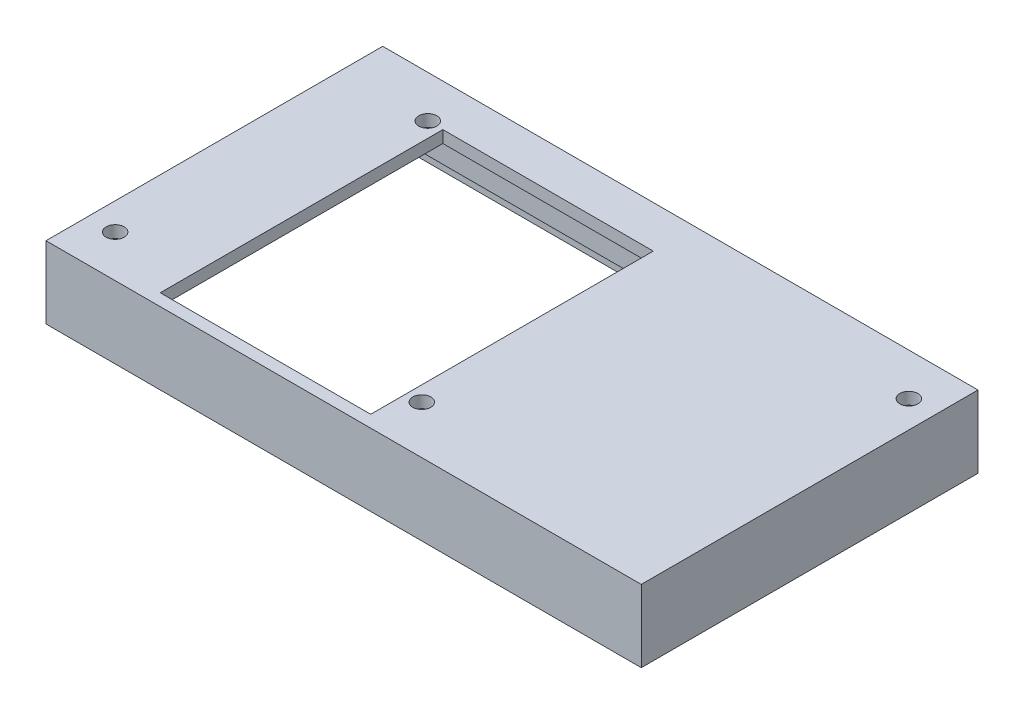
ISO-10303-21;
HEADER;
FILE_DESCRIPTION(('STEP AP214'),'2;1');
FILE_NAME('part.step','',(''),(''),'','','');
FILE_SCHEMA(('AUTOMOTIVE_DESIGN { 1 0 10303 214 1 1 1 1 }'));
ENDSEC;
DATA;
#1=APPLICATION_CONTEXT('core data for automotive mechanical design processes');
#2=APPLICATION_PROTOCOL_DEFINITION('international standard','automotive_design',2000,#1);
#3=PRODUCT_CONTEXT('',#1,'mechanical');
#4=PRODUCT('Part','Part','',(#3));
#5=PRODUCT_RELATED_PRODUCT_CATEGORY('part','',(#4));
#6=PRODUCT_DEFINITION_FORMATION('','',#4);
#7=PRODUCT_DEFINITION_CONTEXT('part definition',#1,'design');
#8=PRODUCT_DEFINITION('design','',#6,#7);
#9=PRODUCT_DEFINITION_SHAPE('','',#8);
#10=(LENGTH_UNIT() NAMED_UNIT(*) SI_UNIT(.MILLI.,.METRE.));
#11=(NAMED_UNIT(*) PLANE_ANGLE_UNIT() SI_UNIT($,.RADIAN.));
#12=(NAMED_UNIT(*) SI_UNIT($,.STERADIAN.) SOLID_ANGLE_UNIT());
#13=UNCERTAINTY_MEASURE_WITH_UNIT(LENGTH_MEASURE(1.E-05),#10,'distance_accuracy_value','');
#14=(GEOMETRIC_REPRESENTATION_CONTEXT(3) GLOBAL_UNCERTAINTY_ASSIGNED_CONTEXT((#13)) GLOBAL_UNIT_ASSIGNED_CONTEXT((#10,
#11,#12)) REPRESENTATION_CONTEXT('',''));
#15=CARTESIAN_POINT('',(0.,0.,0.));
#16=DIRECTION('',(0.,0.,1.));
#17=DIRECTION('',(1.,0.,0.));
#18=AXIS2_PLACEMENT_3D('',#15,#16,#17);
#19=CARTESIAN_POINT('',(0.,-10.,-27.));
#20=DIRECTION('',(0.,0.,1.));
#21=DIRECTION('',(1.,0.,0.));
#22=AXIS2_PLACEMENT_3D('',#19,#20,#21);
#23=PLANE('',#22);
#24=DIRECTION('',(1.,0.,0.));
#25=VECTOR('',#24,1.);
#26=CARTESIAN_POINT('',(0.,-8.,-27.));
#27=LINE('',#26,#25);
#28=CARTESIAN_POINT('',(29.5,-8.,-27.));
#29=VERTEX_POINT('',#28);
#30=CARTESIAN_POINT('',(48.5,-8.,-27.));
#31=VERTEX_POINT('',#30);
#32=EDGE_CURVE('E441',#29,#31,#27,.T.);
#33=ORIENTED_EDGE('',*,*,#32,.F.);
#34=DIRECTION('',(0.,1.,0.));
#35=VECTOR('',#34,1.);
#36=CARTESIAN_POINT('',(29.5,-10.,-27.));
#37=LINE('',#36,#35);
#38=CARTESIAN_POINT('',(29.5,-10.,-27.));
#39=VERTEX_POINT('',#38);
#40=EDGE_CURVE('E57',#39,#29,#37,.T.);
#41=ORIENTED_EDGE('',*,*,#40,.F.);
#42=DIRECTION('',(1.,0.,0.));
#43=VECTOR('',#42,1.);
#44=CARTESIAN_POINT('',(0.,-10.,-27.));
#45=LINE('',#44,#43);
#46=CARTESIAN_POINT('',(48.5,-10.,-27.));
#47=VERTEX_POINT('',#46);
#48=EDGE_CURVE('E321',#39,#47,#45,.T.);
#49=ORIENTED_EDGE('',*,*,#48,.T.);
#50=DIRECTION('',(0.,1.,0.));
#51=VECTOR('',#50,1.);
#52=CARTESIAN_POINT('',(48.5,-10.,-27.));
#53=LINE('',#52,#51);
#54=EDGE_CURVE('E338',#47,#31,#53,.T.);
#55=ORIENTED_EDGE('',*,*,#54,.T.);
#56=EDGE_LOOP('',(#33,#41,#49,#55));
#57=FACE_BOUND('',#56,.T.);
#58=ADVANCED_FACE('F41',(#57),#23,.T.);
#59=CARTESIAN_POINT('',(0.,-10.,0.));
#60=DIRECTION('',(0.,1.,0.));
#61=DIRECTION('',(0.,0.,1.));
#62=AXIS2_PLACEMENT_3D('',#59,#60,#61);
#63=PLANE('',#62);
#64=DIRECTION('',(0.,0.,-1.));
#65=VECTOR('',#64,1.);
#66=CARTESIAN_POINT('',(29.5,-10.,28.001));
#67=LINE('',#66,#65);
#68=CARTESIAN_POINT('',(29.5,-10.,-28.));
#69=VERTEX_POINT('',#68);
#70=EDGE_CURVE('E524',#39,#69,#67,.T.);
#71=ORIENTED_EDGE('',*,*,#70,.T.);
#72=DIRECTION('',(1.,0.,0.));
#73=VECTOR('',#72,1.);
#74=CARTESIAN_POINT('',(0.,-10.,-28.));
#75=LINE('',#74,#73);
#76=CARTESIAN_POINT('',(49.5,-10.,-28.));
#77=VERTEX_POINT('',#76);
#78=EDGE_CURVE('E307',#69,#77,#75,.T.);
#79=ORIENTED_EDGE('',*,*,#78,.T.);
#80=DIRECTION('',(0.,0.,1.));
#81=VECTOR('',#80,1.);
#82=CARTESIAN_POINT('',(49.5,-10.,0.));
#83=LINE('',#82,#81);
#84=CARTESIAN_POINT('',(49.5,-10.,28.));
#85=VERTEX_POINT('',#84);
#86=EDGE_CURVE('E295',#77,#85,#83,.T.);
#87=ORIENTED_EDGE('',*,*,#86,.T.);
#88=DIRECTION('',(1.,0.,0.));
#89=VECTOR('',#88,1.);
#90=CARTESIAN_POINT('',(0.,-10.,28.));
#91=LINE('',#90,#89);
#92=CARTESIAN_POINT('',(-49.5,-10.,28.));
#93=VERTEX_POINT('',#92);
#94=EDGE_CURVE('E317',#93,#85,#91,.T.);
#95=ORIENTED_EDGE('',*,*,#94,.F.);
#96=DIRECTION('',(0.,0.,1.));
#97=VECTOR('',#96,1.);
#98=CARTESIAN_POINT('',(-49.5,-10.,0.));
#99=LINE('',#98,#97);
#100=CARTESIAN_POINT('',(-49.5,-10.,7.99999999999999));
#101=VERTEX_POINT('',#100);
#102=EDGE_CURVE('E312',#101,#93,#99,.T.);
#103=ORIENTED_EDGE('',*,*,#102,.F.);
#104=DIRECTION('',(-1.,0.,0.));
#105=VECTOR('',#104,1.);
#106=CARTESIAN_POINT('',(-26.8844718719117,-10.,7.99999999999999));
#107=LINE('',#106,#105);
#108=CARTESIAN_POINT('',(-48.5,-10.,7.99999999999999));
#109=VERTEX_POINT('',#108);
#110=EDGE_CURVE('E496',#109,#101,#107,.T.);
#111=ORIENTED_EDGE('',*,*,#110,.F.);
#112=DIRECTION('',(0.,0.,1.));
#113=VECTOR('',#112,1.);
#114=CARTESIAN_POINT('',(-48.5,-10.,0.));
#115=LINE('',#114,#113);
#116=CARTESIAN_POINT('',(-48.5,-10.,27.));
#117=VERTEX_POINT('',#116);
#118=EDGE_CURVE('E333',#109,#117,#115,.T.);
#119=ORIENTED_EDGE('',*,*,#118,.T.);
#120=DIRECTION('',(1.,0.,0.));
#121=VECTOR('',#120,1.);
#122=CARTESIAN_POINT('',(0.,-10.,27.));
#123=LINE('',#122,#121);
#124=CARTESIAN_POINT('',(48.5,-10.,27.));
#125=VERTEX_POINT('',#124);
#126=EDGE_CURVE('E330',#117,#125,#123,.T.);
#127=ORIENTED_EDGE('',*,*,#126,.T.);
#128=DIRECTION('',(0.,0.,1.));
#129=VECTOR('',#128,1.);
#130=CARTESIAN_POINT('',(48.5,-10.,0.));
#131=LINE('',#130,#129);
#132=EDGE_CURVE('E326',#47,#125,#131,.T.);
#133=ORIENTED_EDGE('',*,*,#132,.F.);
#134=ORIENTED_EDGE('',*,*,#48,.F.);
#135=EDGE_LOOP('',(#71,#79,#87,#95,#103,#111,#119,#127,#133,#134));
#136=FACE_BOUND('',#135,.T.);
#137=ADVANCED_FACE('F586',(#136),#63,.F.);
#138=CARTESIAN_POINT('',(0.,-8.,0.));
#139=DIRECTION('',(0.,1.,0.));
#140=DIRECTION('',(0.,0.,1.));
#141=AXIS2_PLACEMENT_3D('',#138,#139,#140);
#142=PLANE('',#141);
#143=DIRECTION('',(0.,0.,-1.));
#144=VECTOR('',#143,1.);
#145=CARTESIAN_POINT('',(29.5,-8.,28.001));
#146=LINE('',#145,#144);
#147=CARTESIAN_POINT('',(29.5,-8.,-26.));
#148=VERTEX_POINT('',#147);
#149=EDGE_CURVE('E225',#148,#29,#146,.T.);
#150=ORIENTED_EDGE('',*,*,#149,.T.);
#151=ORIENTED_EDGE('',*,*,#32,.T.);
#152=DIRECTION('',(0.,0.,1.));
#153=VECTOR('',#152,1.);
#154=CARTESIAN_POINT('',(48.5,-8.,0.));
#155=LINE('',#154,#153);
#156=CARTESIAN_POINT('',(48.5,-8.,27.));
#157=VERTEX_POINT('',#156);
#158=EDGE_CURVE('E291',#31,#157,#155,.T.);
#159=ORIENTED_EDGE('',*,*,#158,.T.);
#160=DIRECTION('',(1.,0.,0.));
#161=VECTOR('',#160,1.);
#162=CARTESIAN_POINT('',(0.,-8.,27.));
#163=LINE('',#162,#161);
#164=CARTESIAN_POINT('',(-48.5,-8.,27.));
#165=VERTEX_POINT('',#164);
#166=EDGE_CURVE('E253',#165,#157,#163,.T.);
#167=ORIENTED_EDGE('',*,*,#166,.F.);
#168=DIRECTION('',(0.,0.,1.));
#169=VECTOR('',#168,1.);
#170=CARTESIAN_POINT('',(-48.5,-8.,0.));
#171=LINE('',#170,#169);
#172=CARTESIAN_POINT('',(-48.5,-8.,7.99999999999999));
#173=VERTEX_POINT('',#172);
#174=EDGE_CURVE('E435',#173,#165,#171,.T.);
#175=ORIENTED_EDGE('',*,*,#174,.F.);
#176=DIRECTION('',(1.,0.,0.));
#177=VECTOR('',#176,1.);
#178=CARTESIAN_POINT('',(0.,-8.,7.99999999999999));
#179=LINE('',#178,#177);
#180=CARTESIAN_POINT('',(-47.5,-8.,7.99999999999999));
#181=VERTEX_POINT('',#180);
#182=EDGE_CURVE('E11',#173,#181,#179,.T.);
#183=ORIENTED_EDGE('',*,*,#182,.T.);
#184=DIRECTION('',(0.,0.,1.));
#185=VECTOR('',#184,1.);
#186=CARTESIAN_POINT('',(-47.5,-8.,0.));
#187=LINE('',#186,#185);
#188=CARTESIAN_POINT('',(-47.5,-8.,26.));
#189=VERTEX_POINT('',#188);
#190=EDGE_CURVE('E268',#181,#189,#187,.T.);
#191=ORIENTED_EDGE('',*,*,#190,.T.);
#192=DIRECTION('',(1.,0.,0.));
#193=VECTOR('',#192,1.);
#194=CARTESIAN_POINT('',(0.,-8.,26.));
#195=LINE('',#194,#193);
#196=CARTESIAN_POINT('',(47.5,-8.,26.));
#197=VERTEX_POINT('',#196);
#198=EDGE_CURVE('E265',#189,#197,#195,.T.);
#199=ORIENTED_EDGE('',*,*,#198,.T.);
#200=DIRECTION('',(0.,0.,1.));
#201=VECTOR('',#200,1.);
#202=CARTESIAN_POINT('',(47.5,-8.,0.));
#203=LINE('',#202,#201);
#204=CARTESIAN_POINT('',(47.5,-8.,-26.));
#205=VERTEX_POINT('',#204);
#206=EDGE_CURVE('E250',#205,#197,#203,.T.);
#207=ORIENTED_EDGE('',*,*,#206,.F.);
#208=DIRECTION('',(1.,0.,0.));
#209=VECTOR('',#208,1.);
#210=CARTESIAN_POINT('',(0.,-8.,-26.));
#211=LINE('',#210,#209);
#212=EDGE_CURVE('E240',#148,#205,#211,.T.);
#213=ORIENTED_EDGE('',*,*,#212,.F.);
#214=EDGE_LOOP('',(#150,#151,#159,#167,#175,#183,#191,#199,#207,#213));
#215=FACE_BOUND('',#214,.T.);
#216=ADVANCED_FACE('F248',(#215),#142,.F.);
#217=CARTESIAN_POINT('',(-48.5,-10.,0.));
#218=DIRECTION('',(-1.,0.,0.));
#219=DIRECTION('',(0.,0.,1.));
#220=AXIS2_PLACEMENT_3D('',#217,#218,#219);
#221=PLANE('',#220);
#222=ORIENTED_EDGE('',*,*,#118,.F.);
#223=DIRECTION('',(0.,1.,0.));
#224=VECTOR('',#223,1.);
#225=CARTESIAN_POINT('',(-48.5,-10.,7.99999999999999));
#226=LINE('',#225,#224);
#227=EDGE_CURVE('E475',#109,#173,#226,.T.);
#228=ORIENTED_EDGE('',*,*,#227,.T.);
#229=ORIENTED_EDGE('',*,*,#174,.T.);
#230=DIRECTION('',(0.,1.,0.));
#231=VECTOR('',#230,1.);
#232=CARTESIAN_POINT('',(-48.5,-10.,27.));
#233=LINE('',#232,#231);
#234=EDGE_CURVE('E344',#117,#165,#233,.T.);
#235=ORIENTED_EDGE('',*,*,#234,.F.);
#236=EDGE_LOOP('',(#222,#228,#229,#235));
#237=FACE_BOUND('',#236,.T.);
#238=ADVANCED_FACE('F665',(#237),#221,.F.);
#239=CARTESIAN_POINT('',(0.,0.,0.));
#240=DIRECTION('',(0.,1.,0.));
#241=DIRECTION('',(0.,0.,1.));
#242=AXIS2_PLACEMENT_3D('',#239,#240,#241);
#243=PLANE('',#242);
#244=CARTESIAN_POINT('',(45.,0.,-21.));
#245=DIRECTION('',(0.,-1.,0.));
#246=DIRECTION('',(0.,0.,-1.));
#247=AXIS2_PLACEMENT_3D('',#244,#245,#246);
#248=CIRCLE('',#247,1.5);
#249=CARTESIAN_POINT('',(45.,0.,-22.5));
#250=VERTEX_POINT('',#249);
#251=EDGE_CURVE('E471',#250,#250,#248,.T.);
#252=ORIENTED_EDGE('',*,*,#251,.F.);
#253=EDGE_LOOP('',(#252));
#254=FACE_BOUND('',#253,.T.);
#255=CARTESIAN_POINT('',(-45.,0.,21.));
#256=DIRECTION('',(0.,-1.,0.));
#257=DIRECTION('',(0.,0.,-1.));
#258=AXIS2_PLACEMENT_3D('',#255,#256,#257);
#259=CIRCLE('',#258,1.5);
#260=CARTESIAN_POINT('',(-45.,0.,19.5));
#261=VERTEX_POINT('',#260);
#262=EDGE_CURVE('E463',#261,#261,#259,.T.);
#263=ORIENTED_EDGE('',*,*,#262,.F.);
#264=EDGE_LOOP('',(#263));
#265=FACE_BOUND('',#264,.T.);
#266=CARTESIAN_POINT('',(-35.,0.,-21.));
#267=DIRECTION('',(0.,-1.,0.));
#268=DIRECTION('',(0.,0.,-1.));
#269=AXIS2_PLACEMENT_3D('',#266,#267,#268);
#270=CIRCLE('',#269,1.5);
#271=CARTESIAN_POINT('',(-35.,0.,-22.5));
#272=VERTEX_POINT('',#271);
#273=EDGE_CURVE('E455',#272,#272,#270,.T.);
#274=ORIENTED_EDGE('',*,*,#273,.F.);
#275=EDGE_LOOP('',(#274));
#276=FACE_BOUND('',#275,.T.);
#277=CARTESIAN_POINT('',(5.,0.,20.));
#278=DIRECTION('',(0.,-1.,0.));
#279=DIRECTION('',(0.,0.,-1.));
#280=AXIS2_PLACEMENT_3D('',#277,#278,#279);
#281=CIRCLE('',#280,1.5);
#282=CARTESIAN_POINT('',(5.,0.,18.5));
#283=VERTEX_POINT('',#282);
#284=EDGE_CURVE('E447',#283,#283,#281,.T.);
#285=ORIENTED_EDGE('',*,*,#284,.F.);
#286=EDGE_LOOP('',(#285));
#287=FACE_BOUND('',#286,.T.);
#288=DIRECTION('',(1.,0.,0.));
#289=VECTOR('',#288,1.);
#290=CARTESIAN_POINT('',(0.,0.,26.));
#291=LINE('',#290,#289);
#292=CARTESIAN_POINT('',(-47.5,0.,26.));
#293=VERTEX_POINT('',#292);
#294=CARTESIAN_POINT('',(-32.5,0.,26.));
#295=VERTEX_POINT('',#294);
#296=EDGE_CURVE('E284',#293,#295,#291,.T.);
#297=ORIENTED_EDGE('',*,*,#296,.F.);
#298=DIRECTION('',(0.,0.,1.));
#299=VECTOR('',#298,1.);
#300=CARTESIAN_POINT('',(-47.5,0.,0.));
#301=LINE('',#300,#299);
#302=CARTESIAN_POINT('',(-47.5,0.,-26.));
#303=VERTEX_POINT('',#302);
#304=EDGE_CURVE('E287',#303,#293,#301,.T.);
#305=ORIENTED_EDGE('',*,*,#304,.F.);
#306=DIRECTION('',(1.,0.,0.));
#307=VECTOR('',#306,1.);
#308=CARTESIAN_POINT('',(0.,0.,-26.));
#309=LINE('',#308,#307);
#310=CARTESIAN_POINT('',(47.5,0.,-26.));
#311=VERTEX_POINT('',#310);
#312=EDGE_CURVE('E274',#303,#311,#309,.T.);
#313=ORIENTED_EDGE('',*,*,#312,.T.);
#314=DIRECTION('',(0.,0.,1.));
#315=VECTOR('',#314,1.);
#316=CARTESIAN_POINT('',(47.5,0.,0.));
#317=LINE('',#316,#315);
#318=CARTESIAN_POINT('',(47.5,0.,26.));
#319=VERTEX_POINT('',#318);
#320=EDGE_CURVE('E278',#311,#319,#317,.T.);
#321=ORIENTED_EDGE('',*,*,#320,.T.);
#322=CARTESIAN_POINT('',(2.5,0.,26.));
#323=VERTEX_POINT('',#322);
#324=EDGE_CURVE('E283',#323,#319,#291,.T.);
#325=ORIENTED_EDGE('',*,*,#324,.F.);
#326=DIRECTION('',(0.,0.,1.));
#327=VECTOR('',#326,1.);
#328=CARTESIAN_POINT('',(2.5,0.,0.));
#329=LINE('',#328,#327);
#330=CARTESIAN_POINT('',(2.5,0.,-21.));
#331=VERTEX_POINT('',#330);
#332=EDGE_CURVE('E343',#331,#323,#329,.T.);
#333=ORIENTED_EDGE('',*,*,#332,.F.);
#334=DIRECTION('',(1.,0.,0.));
#335=VECTOR('',#334,1.);
#336=CARTESIAN_POINT('',(0.,0.,-21.));
#337=LINE('',#336,#335);
#338=CARTESIAN_POINT('',(-32.5,0.,-21.));
#339=VERTEX_POINT('',#338);
#340=EDGE_CURVE('E359',#339,#331,#337,.T.);
#341=ORIENTED_EDGE('',*,*,#340,.F.);
#342=DIRECTION('',(0.,0.,1.));
#343=VECTOR('',#342,1.);
#344=CARTESIAN_POINT('',(-32.5,0.,0.));
#345=LINE('',#344,#343);
#346=EDGE_CURVE('E389',#339,#295,#345,.T.);
#347=ORIENTED_EDGE('',*,*,#346,.T.);
#348=EDGE_LOOP('',(#297,#305,#313,#321,#325,#333,#341,#347));
#349=FACE_BOUND('',#348,.T.);
#350=ADVANCED_FACE('F601',(#254,#265,#276,#287,#349),#243,.F.);
#351=DIRECTION('',(0.,1.,0.));
#352=VECTOR('',#351,1.);
#353=CARTESIAN_POINT('',(19.5,-10.,-27.));
#354=LINE('',#353,#352);
#355=CARTESIAN_POINT('',(19.5,-10.,-27.));
#356=VERTEX_POINT('',#355);
#357=CARTESIAN_POINT('',(19.5,-8.,-27.));
#358=VERTEX_POINT('',#357);
#359=EDGE_CURVE('E538',#356,#358,#354,.T.);
#360=ORIENTED_EDGE('',*,*,#359,.T.);
#361=CARTESIAN_POINT('',(-48.5,-8.,-27.));
#362=VERTEX_POINT('',#361);
#363=EDGE_CURVE('E437',#362,#358,#27,.T.);
#364=ORIENTED_EDGE('',*,*,#363,.F.);
#365=DIRECTION('',(0.,1.,0.));
#366=VECTOR('',#365,1.);
#367=CARTESIAN_POINT('',(-48.5,-10.,-27.));
#368=LINE('',#367,#366);
#369=CARTESIAN_POINT('',(-48.5,-10.,-27.));
#370=VERTEX_POINT('',#369);
#371=EDGE_CURVE('E339',#370,#362,#368,.T.);
#372=ORIENTED_EDGE('',*,*,#371,.F.);
#373=EDGE_CURVE('E322',#370,#356,#45,.T.);
#374=ORIENTED_EDGE('',*,*,#373,.T.);
#375=EDGE_LOOP('',(#360,#364,#372,#374));
#376=FACE_BOUND('',#375,.T.);
#377=ADVANCED_FACE('F550',(#376),#23,.T.);
#378=CARTESIAN_POINT('',(-48.5,-8.,-12.));
#379=VERTEX_POINT('',#378);
#380=EDGE_CURVE('E259',#362,#379,#171,.T.);
#381=ORIENTED_EDGE('',*,*,#380,.T.);
#382=DIRECTION('',(0.,-1.,0.));
#383=VECTOR('',#382,1.);
#384=CARTESIAN_POINT('',(-48.5,-10.,-12.));
#385=LINE('',#384,#383);
#386=CARTESIAN_POINT('',(-48.5,-10.,-12.));
#387=VERTEX_POINT('',#386);
#388=EDGE_CURVE('E65',#379,#387,#385,.T.);
#389=ORIENTED_EDGE('',*,*,#388,.T.);
#390=EDGE_CURVE('E334',#370,#387,#115,.T.);
#391=ORIENTED_EDGE('',*,*,#390,.F.);
#392=ORIENTED_EDGE('',*,*,#371,.T.);
#393=EDGE_LOOP('',(#381,#389,#391,#392));
#394=FACE_BOUND('',#393,.T.);
#395=ADVANCED_FACE('F432',(#394),#221,.F.);
#396=CARTESIAN_POINT('',(0.,-10.,27.));
#397=DIRECTION('',(0.,0.,1.));
#398=DIRECTION('',(1.,0.,0.));
#399=AXIS2_PLACEMENT_3D('',#396,#397,#398);
#400=PLANE('',#399);
#401=ORIENTED_EDGE('',*,*,#166,.T.);
#402=DIRECTION('',(0.,1.,0.));
#403=VECTOR('',#402,1.);
#404=CARTESIAN_POINT('',(48.5,-10.,27.));
#405=LINE('',#404,#403);
#406=EDGE_CURVE('E348',#125,#157,#405,.T.);
#407=ORIENTED_EDGE('',*,*,#406,.F.);
#408=ORIENTED_EDGE('',*,*,#126,.F.);
#409=ORIENTED_EDGE('',*,*,#234,.T.);
#410=EDGE_LOOP('',(#401,#407,#408,#409));
#411=FACE_BOUND('',#410,.T.);
#412=ADVANCED_FACE('F663',(#411),#400,.F.);
#413=CARTESIAN_POINT('',(48.5,-10.,0.));
#414=DIRECTION('',(-1.,0.,0.));
#415=DIRECTION('',(0.,0.,1.));
#416=AXIS2_PLACEMENT_3D('',#413,#414,#415);
#417=PLANE('',#416);
#418=ORIENTED_EDGE('',*,*,#406,.T.);
#419=ORIENTED_EDGE('',*,*,#158,.F.);
#420=ORIENTED_EDGE('',*,*,#54,.F.);
#421=ORIENTED_EDGE('',*,*,#132,.T.);
#422=EDGE_LOOP('',(#418,#419,#420,#421));
#423=FACE_BOUND('',#422,.T.);
#424=ADVANCED_FACE('F625',(#423),#417,.T.);
#425=CARTESIAN_POINT('',(49.5,2.,0.));
#426=DIRECTION('',(1.,0.,0.));
#427=DIRECTION('',(0.,0.,-1.));
#428=AXIS2_PLACEMENT_3D('',#425,#426,#427);
#429=PLANE('',#428);
#430=DIRECTION('',(0.,-1.,0.));
#431=VECTOR('',#430,1.);
#432=CARTESIAN_POINT('',(49.5,2.,28.));
#433=LINE('',#432,#431);
#434=CARTESIAN_POINT('',(49.5,2.,28.));
#435=VERTEX_POINT('',#434);
#436=EDGE_CURVE('E395',#435,#85,#433,.T.);
#437=ORIENTED_EDGE('',*,*,#436,.T.);
#438=ORIENTED_EDGE('',*,*,#86,.F.);
#439=DIRECTION('',(0.,-1.,0.));
#440=VECTOR('',#439,1.);
#441=CARTESIAN_POINT('',(49.5,2.,-28.));
#442=LINE('',#441,#440);
#443=CARTESIAN_POINT('',(49.5,2.,-28.));
#444=VERTEX_POINT('',#443);
#445=EDGE_CURVE('E406',#444,#77,#442,.T.);
#446=ORIENTED_EDGE('',*,*,#445,.F.);
#447=DIRECTION('',(0.,0.,1.));
#448=VECTOR('',#447,1.);
#449=CARTESIAN_POINT('',(49.5,2.,0.));
#450=LINE('',#449,#448);
#451=EDGE_CURVE('E370',#444,#435,#450,.T.);
#452=ORIENTED_EDGE('',*,*,#451,.T.);
#453=EDGE_LOOP('',(#437,#438,#446,#452));
#454=FACE_BOUND('',#453,.T.);
#455=ADVANCED_FACE('F637',(#454),#429,.T.);
#456=CARTESIAN_POINT('',(0.,2.,-28.));
#457=DIRECTION('',(0.,0.,-1.));
#458=DIRECTION('',(-1.,0.,0.));
#459=AXIS2_PLACEMENT_3D('',#456,#457,#458);
#460=PLANE('',#459);
#461=DIRECTION('',(0.,1.,0.));
#462=VECTOR('',#461,1.);
#463=CARTESIAN_POINT('',(19.5,-10.,-28.));
#464=LINE('',#463,#462);
#465=CARTESIAN_POINT('',(19.5,-10.,-28.));
#466=VERTEX_POINT('',#465);
#467=CARTESIAN_POINT('',(19.5,-5.,-28.));
#468=VERTEX_POINT('',#467);
#469=EDGE_CURVE('E534',#466,#468,#464,.T.);
#470=ORIENTED_EDGE('',*,*,#469,.F.);
#471=CARTESIAN_POINT('',(-49.5,-10.,-28.));
#472=VERTEX_POINT('',#471);
#473=EDGE_CURVE('E308',#472,#466,#75,.T.);
#474=ORIENTED_EDGE('',*,*,#473,.F.);
#475=DIRECTION('',(0.,-1.,0.));
#476=VECTOR('',#475,1.);
#477=CARTESIAN_POINT('',(-49.5,2.,-28.));
#478=LINE('',#477,#476);
#479=CARTESIAN_POINT('',(-49.5,2.,-28.));
#480=VERTEX_POINT('',#479);
#481=EDGE_CURVE('E403',#480,#472,#478,.T.);
#482=ORIENTED_EDGE('',*,*,#481,.F.);
#483=DIRECTION('',(1.,0.,0.));
#484=VECTOR('',#483,1.);
#485=CARTESIAN_POINT('',(0.,2.,-28.));
#486=LINE('',#485,#484);
#487=EDGE_CURVE('E374',#480,#444,#486,.T.);
#488=ORIENTED_EDGE('',*,*,#487,.T.);
#489=ORIENTED_EDGE('',*,*,#445,.T.);
#490=ORIENTED_EDGE('',*,*,#78,.F.);
#491=DIRECTION('',(0.,1.,0.));
#492=VECTOR('',#491,1.);
#493=CARTESIAN_POINT('',(29.5,-10.,-28.));
#494=LINE('',#493,#492);
#495=CARTESIAN_POINT('',(29.5,-5.,-28.));
#496=VERTEX_POINT('',#495);
#497=EDGE_CURVE('E235',#69,#496,#494,.T.);
#498=ORIENTED_EDGE('',*,*,#497,.T.);
#499=DIRECTION('',(-1.,0.,0.));
#500=VECTOR('',#499,1.);
#501=CARTESIAN_POINT('',(29.5,-5.,-28.));
#502=LINE('',#501,#500);
#503=EDGE_CURVE('E523',#496,#468,#502,.T.);
#504=ORIENTED_EDGE('',*,*,#503,.T.);
#505=EDGE_LOOP('',(#470,#474,#482,#488,#489,#490,#498,#504));
#506=FACE_BOUND('',#505,.T.);
#507=ADVANCED_FACE('F579',(#506),#460,.T.);
#508=CARTESIAN_POINT('',(-49.5,2.,0.));
#509=DIRECTION('',(1.,0.,0.));
#510=DIRECTION('',(0.,0.,-1.));
#511=AXIS2_PLACEMENT_3D('',#508,#509,#510);
#512=PLANE('',#511);
#513=DIRECTION('',(0.,0.,-1.));
#514=VECTOR('',#513,1.);
#515=CARTESIAN_POINT('',(-49.5,-5.,7.99999999999999));
#516=LINE('',#515,#514);
#517=CARTESIAN_POINT('',(-49.5,-5.,7.99999999999999));
#518=VERTEX_POINT('',#517);
#519=CARTESIAN_POINT('',(-49.5,-5.,-12.));
#520=VERTEX_POINT('',#519);
#521=EDGE_CURVE('E502',#518,#520,#516,.T.);
#522=ORIENTED_EDGE('',*,*,#521,.F.);
#523=DIRECTION('',(0.,1.,0.));
#524=VECTOR('',#523,1.);
#525=CARTESIAN_POINT('',(-49.5,-10.,7.99999999999999));
#526=LINE('',#525,#524);
#527=EDGE_CURVE('E506',#101,#518,#526,.T.);
#528=ORIENTED_EDGE('',*,*,#527,.F.);
#529=ORIENTED_EDGE('',*,*,#102,.T.);
#530=DIRECTION('',(0.,-1.,0.));
#531=VECTOR('',#530,1.);
#532=CARTESIAN_POINT('',(-49.5,2.,28.));
#533=LINE('',#532,#531);
#534=CARTESIAN_POINT('',(-49.5,2.,28.));
#535=VERTEX_POINT('',#534);
#536=EDGE_CURVE('E398',#535,#93,#533,.T.);
#537=ORIENTED_EDGE('',*,*,#536,.F.);
#538=DIRECTION('',(0.,0.,1.));
#539=VECTOR('',#538,1.);
#540=CARTESIAN_POINT('',(-49.5,2.,0.));
#541=LINE('',#540,#539);
#542=EDGE_CURVE('E378',#480,#535,#541,.T.);
#543=ORIENTED_EDGE('',*,*,#542,.F.);
#544=ORIENTED_EDGE('',*,*,#481,.T.);
#545=CARTESIAN_POINT('',(-49.5,-10.,-12.));
#546=VERTEX_POINT('',#545);
#547=EDGE_CURVE('E313',#472,#546,#99,.T.);
#548=ORIENTED_EDGE('',*,*,#547,.T.);
#549=DIRECTION('',(0.,-1.,0.));
#550=VECTOR('',#549,1.);
#551=CARTESIAN_POINT('',(-49.5,-10.,-12.));
#552=LINE('',#551,#550);
#553=EDGE_CURVE('E489',#520,#546,#552,.T.);
#554=ORIENTED_EDGE('',*,*,#553,.F.);
#555=EDGE_LOOP('',(#522,#528,#529,#537,#543,#544,#548,#554));
#556=FACE_BOUND('',#555,.T.);
#557=ADVANCED_FACE('F571',(#556),#512,.F.);
#558=CARTESIAN_POINT('',(2.5,2.,0.));
#559=DIRECTION('',(1.,0.,0.));
#560=DIRECTION('',(0.,0.,-1.));
#561=AXIS2_PLACEMENT_3D('',#558,#559,#560);
#562=PLANE('',#561);
#563=ORIENTED_EDGE('',*,*,#332,.T.);
#564=DIRECTION('',(0.,-1.,0.));
#565=VECTOR('',#564,1.);
#566=CARTESIAN_POINT('',(2.5,2.,26.));
#567=LINE('',#566,#565);
#568=CARTESIAN_POINT('',(2.5,2.,26.));
#569=VERTEX_POINT('',#568);
#570=EDGE_CURVE('E399',#569,#323,#567,.T.);
#571=ORIENTED_EDGE('',*,*,#570,.F.);
#572=DIRECTION('',(0.,0.,1.));
#573=VECTOR('',#572,1.);
#574=CARTESIAN_POINT('',(2.5,2.,0.));
#575=LINE('',#574,#573);
#576=CARTESIAN_POINT('',(2.5,2.,-21.));
#577=VERTEX_POINT('',#576);
#578=EDGE_CURVE('E355',#577,#569,#575,.T.);
#579=ORIENTED_EDGE('',*,*,#578,.F.);
#580=DIRECTION('',(0.,-1.,0.));
#581=VECTOR('',#580,1.);
#582=CARTESIAN_POINT('',(2.5,2.,-21.));
#583=LINE('',#582,#581);
#584=EDGE_CURVE('E385',#577,#331,#583,.T.);
#585=ORIENTED_EDGE('',*,*,#584,.T.);
#586=EDGE_LOOP('',(#563,#571,#579,#585));
#587=FACE_BOUND('',#586,.T.);
#588=ADVANCED_FACE('F43',(#587),#562,.F.);
#589=CARTESIAN_POINT('',(0.,2.,26.));
#590=DIRECTION('',(0.,0.,-1.));
#591=DIRECTION('',(-1.,0.,0.));
#592=AXIS2_PLACEMENT_3D('',#589,#590,#591);
#593=PLANE('',#592);
#594=ORIENTED_EDGE('',*,*,#570,.T.);
#595=ORIENTED_EDGE('',*,*,#324,.T.);
#596=DIRECTION('',(0.,1.,0.));
#597=VECTOR('',#596,1.);
#598=CARTESIAN_POINT('',(47.5,-8.,26.));
#599=LINE('',#598,#597);
#600=EDGE_CURVE('E299',#197,#319,#599,.T.);
#601=ORIENTED_EDGE('',*,*,#600,.F.);
#602=ORIENTED_EDGE('',*,*,#198,.F.);
#603=DIRECTION('',(0.,1.,0.));
#604=VECTOR('',#603,1.);
#605=CARTESIAN_POINT('',(-47.5,-8.,26.));
#606=LINE('',#605,#604);
#607=EDGE_CURVE('E296',#189,#293,#606,.T.);
#608=ORIENTED_EDGE('',*,*,#607,.T.);
#609=ORIENTED_EDGE('',*,*,#296,.T.);
#610=DIRECTION('',(0.,-1.,0.));
#611=VECTOR('',#610,1.);
#612=CARTESIAN_POINT('',(-32.5,2.,26.));
#613=LINE('',#612,#611);
#614=CARTESIAN_POINT('',(-32.5,2.,26.));
#615=VERTEX_POINT('',#614);
#616=EDGE_CURVE('E416',#615,#295,#613,.T.);
#617=ORIENTED_EDGE('',*,*,#616,.F.);
#618=DIRECTION('',(1.,0.,0.));
#619=VECTOR('',#618,1.);
#620=CARTESIAN_POINT('',(0.,2.,26.));
#621=LINE('',#620,#619);
#622=EDGE_CURVE('E358',#615,#569,#621,.T.);
#623=ORIENTED_EDGE('',*,*,#622,.T.);
#624=EDGE_LOOP('',(#594,#595,#601,#602,#608,#609,#617,#623));
#625=FACE_BOUND('',#624,.T.);
#626=ADVANCED_FACE('F597',(#625),#593,.T.);
#627=CARTESIAN_POINT('',(-32.5,2.,0.));
#628=DIRECTION('',(1.,0.,0.));
#629=DIRECTION('',(0.,0.,-1.));
#630=AXIS2_PLACEMENT_3D('',#627,#628,#629);
#631=PLANE('',#630);
#632=ORIENTED_EDGE('',*,*,#346,.F.);
#633=DIRECTION('',(0.,-1.,0.));
#634=VECTOR('',#633,1.);
#635=CARTESIAN_POINT('',(-32.5,2.,-21.));
#636=LINE('',#635,#634);
#637=CARTESIAN_POINT('',(-32.5,2.,-21.));
#638=VERTEX_POINT('',#637);
#639=EDGE_CURVE('E413',#638,#339,#636,.T.);
#640=ORIENTED_EDGE('',*,*,#639,.F.);
#641=DIRECTION('',(0.,0.,1.));
#642=VECTOR('',#641,1.);
#643=CARTESIAN_POINT('',(-32.5,2.,0.));
#644=LINE('',#643,#642);
#645=EDGE_CURVE('E363',#638,#615,#644,.T.);
#646=ORIENTED_EDGE('',*,*,#645,.T.);
#647=ORIENTED_EDGE('',*,*,#616,.T.);
#648=EDGE_LOOP('',(#632,#640,#646,#647));
#649=FACE_BOUND('',#648,.T.);
#650=ADVANCED_FACE('F606',(#649),#631,.T.);
#651=CARTESIAN_POINT('',(0.,2.,-21.));
#652=DIRECTION('',(0.,0.,-1.));
#653=DIRECTION('',(-1.,0.,0.));
#654=AXIS2_PLACEMENT_3D('',#651,#652,#653);
#655=PLANE('',#654);
#656=ORIENTED_EDGE('',*,*,#340,.T.);
#657=ORIENTED_EDGE('',*,*,#584,.F.);
#658=DIRECTION('',(1.,0.,0.));
#659=VECTOR('',#658,1.);
#660=CARTESIAN_POINT('',(0.,2.,-21.));
#661=LINE('',#660,#659);
#662=EDGE_CURVE('E367',#638,#577,#661,.T.);
#663=ORIENTED_EDGE('',*,*,#662,.F.);
#664=ORIENTED_EDGE('',*,*,#639,.T.);
#665=EDGE_LOOP('',(#656,#657,#663,#664));
#666=FACE_BOUND('',#665,.T.);
#667=ADVANCED_FACE('F648',(#666),#655,.F.);
#668=CARTESIAN_POINT('',(0.,2.,28.));
#669=DIRECTION('',(0.,0.,-1.));
#670=DIRECTION('',(-1.,0.,0.));
#671=AXIS2_PLACEMENT_3D('',#668,#669,#670);
#672=PLANE('',#671);
#673=ORIENTED_EDGE('',*,*,#536,.T.);
#674=ORIENTED_EDGE('',*,*,#94,.T.);
#675=ORIENTED_EDGE('',*,*,#436,.F.);
#676=DIRECTION('',(1.,0.,0.));
#677=VECTOR('',#676,1.);
#678=CARTESIAN_POINT('',(0.,2.,28.));
#679=LINE('',#678,#677);
#680=EDGE_CURVE('E382',#535,#435,#679,.T.);
#681=ORIENTED_EDGE('',*,*,#680,.F.);
#682=EDGE_LOOP('',(#673,#674,#675,#681));
#683=FACE_BOUND('',#682,.T.);
#684=ADVANCED_FACE('F634',(#683),#672,.F.);
#685=CARTESIAN_POINT('',(0.,2.,0.));
#686=DIRECTION('',(0.,1.,0.));
#687=DIRECTION('',(0.,0.,1.));
#688=AXIS2_PLACEMENT_3D('',#685,#686,#687);
#689=PLANE('',#688);
#690=CARTESIAN_POINT('',(45.,2.,-21.));
#691=DIRECTION('',(0.,-1.,0.));
#692=DIRECTION('',(0.,0.,-1.));
#693=AXIS2_PLACEMENT_3D('',#690,#691,#692);
#694=CIRCLE('',#693,1.5);
#695=CARTESIAN_POINT('',(45.,2.,-22.5));
#696=VERTEX_POINT('',#695);
#697=EDGE_CURVE('E467',#696,#696,#694,.T.);
#698=ORIENTED_EDGE('',*,*,#697,.T.);
#699=EDGE_LOOP('',(#698));
#700=FACE_BOUND('',#699,.T.);
#701=CARTESIAN_POINT('',(-45.,2.,21.));
#702=DIRECTION('',(0.,-1.,0.));
#703=DIRECTION('',(0.,0.,-1.));
#704=AXIS2_PLACEMENT_3D('',#701,#702,#703);
#705=CIRCLE('',#704,1.5);
#706=CARTESIAN_POINT('',(-45.,2.,19.5));
#707=VERTEX_POINT('',#706);
#708=EDGE_CURVE('E459',#707,#707,#705,.T.);
#709=ORIENTED_EDGE('',*,*,#708,.T.);
#710=EDGE_LOOP('',(#709));
#711=FACE_BOUND('',#710,.T.);
#712=CARTESIAN_POINT('',(-35.,2.,-21.));
#713=DIRECTION('',(0.,-1.,0.));
#714=DIRECTION('',(0.,0.,-1.));
#715=AXIS2_PLACEMENT_3D('',#712,#713,#714);
#716=CIRCLE('',#715,1.5);
#717=CARTESIAN_POINT('',(-35.,2.,-22.5));
#718=VERTEX_POINT('',#717);
#719=EDGE_CURVE('E451',#718,#718,#716,.T.);
#720=ORIENTED_EDGE('',*,*,#719,.T.);
#721=EDGE_LOOP('',(#720));
#722=FACE_BOUND('',#721,.T.);
#723=CARTESIAN_POINT('',(5.,2.,20.));
#724=DIRECTION('',(0.,-1.,0.));
#725=DIRECTION('',(0.,0.,-1.));
#726=AXIS2_PLACEMENT_3D('',#723,#724,#725);
#727=CIRCLE('',#726,1.5);
#728=CARTESIAN_POINT('',(5.,2.,18.5));
#729=VERTEX_POINT('',#728);
#730=EDGE_CURVE('E279',#729,#729,#727,.T.);
#731=ORIENTED_EDGE('',*,*,#730,.T.);
#732=EDGE_LOOP('',(#731));
#733=FACE_BOUND('',#732,.T.);
#734=ORIENTED_EDGE('',*,*,#578,.T.);
#735=ORIENTED_EDGE('',*,*,#622,.F.);
#736=ORIENTED_EDGE('',*,*,#645,.F.);
#737=ORIENTED_EDGE('',*,*,#662,.T.);
#738=EDGE_LOOP('',(#734,#735,#736,#737));
#739=FACE_BOUND('',#738,.T.);
#740=ORIENTED_EDGE('',*,*,#451,.F.);
#741=ORIENTED_EDGE('',*,*,#487,.F.);
#742=ORIENTED_EDGE('',*,*,#542,.T.);
#743=ORIENTED_EDGE('',*,*,#680,.T.);
#744=EDGE_LOOP('',(#740,#741,#742,#743));
#745=FACE_BOUND('',#744,.T.);
#746=ADVANCED_FACE('F610',(#700,#711,#722,#733,#739,#745),#689,.T.);
#747=ORIENTED_EDGE('',*,*,#473,.T.);
#748=DIRECTION('',(0.,0.,-1.));
#749=VECTOR('',#748,1.);
#750=CARTESIAN_POINT('',(19.5,-10.,28.001));
#751=LINE('',#750,#749);
#752=EDGE_CURVE('E234',#356,#466,#751,.T.);
#753=ORIENTED_EDGE('',*,*,#752,.F.);
#754=ORIENTED_EDGE('',*,*,#373,.F.);
#755=ORIENTED_EDGE('',*,*,#390,.T.);
#756=DIRECTION('',(-1.,0.,0.));
#757=VECTOR('',#756,1.);
#758=CARTESIAN_POINT('',(-26.8844718719117,-10.,-12.));
#759=LINE('',#758,#757);
#760=EDGE_CURVE('E492',#387,#546,#759,.T.);
#761=ORIENTED_EDGE('',*,*,#760,.T.);
#762=ORIENTED_EDGE('',*,*,#547,.F.);
#763=EDGE_LOOP('',(#747,#753,#754,#755,#761,#762));
#764=FACE_BOUND('',#763,.T.);
#765=ADVANCED_FACE('F574',(#764),#63,.F.);
#766=CARTESIAN_POINT('',(0.,-8.,-26.));
#767=DIRECTION('',(0.,0.,1.));
#768=DIRECTION('',(1.,0.,0.));
#769=AXIS2_PLACEMENT_3D('',#766,#767,#768);
#770=PLANE('',#769);
#771=DIRECTION('',(0.,1.,0.));
#772=VECTOR('',#771,1.);
#773=CARTESIAN_POINT('',(19.5,-10.,-26.));
#774=LINE('',#773,#772);
#775=CARTESIAN_POINT('',(19.5,-8.,-26.));
#776=VERTEX_POINT('',#775);
#777=CARTESIAN_POINT('',(19.5,-5.,-26.));
#778=VERTEX_POINT('',#777);
#779=EDGE_CURVE('E520',#776,#778,#774,.T.);
#780=ORIENTED_EDGE('',*,*,#779,.T.);
#781=DIRECTION('',(-1.,0.,0.));
#782=VECTOR('',#781,1.);
#783=CARTESIAN_POINT('',(29.5,-5.,-26.));
#784=LINE('',#783,#782);
#785=CARTESIAN_POINT('',(29.5,-5.,-26.));
#786=VERTEX_POINT('',#785);
#787=EDGE_CURVE('E243',#786,#778,#784,.T.);
#788=ORIENTED_EDGE('',*,*,#787,.F.);
#789=DIRECTION('',(0.,1.,0.));
#790=VECTOR('',#789,1.);
#791=CARTESIAN_POINT('',(29.5,-10.,-26.));
#792=LINE('',#791,#790);
#793=EDGE_CURVE('E228',#148,#786,#792,.T.);
#794=ORIENTED_EDGE('',*,*,#793,.F.);
#795=ORIENTED_EDGE('',*,*,#212,.T.);
#796=DIRECTION('',(0.,1.,0.));
#797=VECTOR('',#796,1.);
#798=CARTESIAN_POINT('',(47.5,-8.,-26.));
#799=LINE('',#798,#797);
#800=EDGE_CURVE('E273',#205,#311,#799,.T.);
#801=ORIENTED_EDGE('',*,*,#800,.T.);
#802=ORIENTED_EDGE('',*,*,#312,.F.);
#803=DIRECTION('',(0.,1.,0.));
#804=VECTOR('',#803,1.);
#805=CARTESIAN_POINT('',(-47.5,-8.,-26.));
#806=LINE('',#805,#804);
#807=CARTESIAN_POINT('',(-47.5,-8.,-26.));
#808=VERTEX_POINT('',#807);
#809=EDGE_CURVE('E292',#808,#303,#806,.T.);
#810=ORIENTED_EDGE('',*,*,#809,.F.);
#811=EDGE_CURVE('E252',#808,#776,#211,.T.);
#812=ORIENTED_EDGE('',*,*,#811,.T.);
#813=EDGE_LOOP('',(#780,#788,#794,#795,#801,#802,#810,#812));
#814=FACE_BOUND('',#813,.T.);
#815=ADVANCED_FACE('F239',(#814),#770,.T.);
#816=CARTESIAN_POINT('',(-47.5,-8.,0.));
#817=DIRECTION('',(-1.,0.,0.));
#818=DIRECTION('',(0.,0.,1.));
#819=AXIS2_PLACEMENT_3D('',#816,#817,#818);
#820=PLANE('',#819);
#821=ORIENTED_EDGE('',*,*,#190,.F.);
#822=DIRECTION('',(0.,-1.,0.));
#823=VECTOR('',#822,1.);
#824=CARTESIAN_POINT('',(-47.5,-10.,7.99999999999999));
#825=LINE('',#824,#823);
#826=CARTESIAN_POINT('',(-47.5,-5.,7.99999999999999));
#827=VERTEX_POINT('',#826);
#828=EDGE_CURVE('E484',#827,#181,#825,.T.);
#829=ORIENTED_EDGE('',*,*,#828,.F.);
#830=DIRECTION('',(0.,0.,1.));
#831=VECTOR('',#830,1.);
#832=CARTESIAN_POINT('',(-47.5,-5.,7.99999999999999));
#833=LINE('',#832,#831);
#834=CARTESIAN_POINT('',(-47.5,-5.,-12.));
#835=VERTEX_POINT('',#834);
#836=EDGE_CURVE('E481',#835,#827,#833,.T.);
#837=ORIENTED_EDGE('',*,*,#836,.F.);
#838=DIRECTION('',(0.,1.,0.));
#839=VECTOR('',#838,1.);
#840=CARTESIAN_POINT('',(-47.5,-10.,-12.));
#841=LINE('',#840,#839);
#842=CARTESIAN_POINT('',(-47.5,-8.,-12.));
#843=VERTEX_POINT('',#842);
#844=EDGE_CURVE('E499',#843,#835,#841,.T.);
#845=ORIENTED_EDGE('',*,*,#844,.F.);
#846=EDGE_CURVE('E269',#808,#843,#187,.T.);
#847=ORIENTED_EDGE('',*,*,#846,.F.);
#848=ORIENTED_EDGE('',*,*,#809,.T.);
#849=ORIENTED_EDGE('',*,*,#304,.T.);
#850=ORIENTED_EDGE('',*,*,#607,.F.);
#851=EDGE_LOOP('',(#821,#829,#837,#845,#847,#848,#849,#850));
#852=FACE_BOUND('',#851,.T.);
#853=ADVANCED_FACE('F559',(#852),#820,.F.);
#854=CARTESIAN_POINT('',(47.5,-8.,0.));
#855=DIRECTION('',(-1.,0.,0.));
#856=DIRECTION('',(0.,0.,1.));
#857=AXIS2_PLACEMENT_3D('',#854,#855,#856);
#858=PLANE('',#857);
#859=ORIENTED_EDGE('',*,*,#320,.F.);
#860=ORIENTED_EDGE('',*,*,#800,.F.);
#861=ORIENTED_EDGE('',*,*,#206,.T.);
#862=ORIENTED_EDGE('',*,*,#600,.T.);
#863=EDGE_LOOP('',(#859,#860,#861,#862));
#864=FACE_BOUND('',#863,.T.);
#865=ADVANCED_FACE('F791',(#864),#858,.T.);
#866=ORIENTED_EDGE('',*,*,#363,.T.);
#867=DIRECTION('',(0.,0.,-1.));
#868=VECTOR('',#867,1.);
#869=CARTESIAN_POINT('',(19.5,-8.,28.001));
#870=LINE('',#869,#868);
#871=EDGE_CURVE('E245',#776,#358,#870,.T.);
#872=ORIENTED_EDGE('',*,*,#871,.F.);
#873=ORIENTED_EDGE('',*,*,#811,.F.);
#874=ORIENTED_EDGE('',*,*,#846,.T.);
#875=DIRECTION('',(-1.,0.,0.));
#876=VECTOR('',#875,1.);
#877=CARTESIAN_POINT('',(0.,-8.,-12.));
#878=LINE('',#877,#876);
#879=EDGE_CURVE('E50',#843,#379,#878,.T.);
#880=ORIENTED_EDGE('',*,*,#879,.T.);
#881=ORIENTED_EDGE('',*,*,#380,.F.);
#882=EDGE_LOOP('',(#866,#872,#873,#874,#880,#881));
#883=FACE_BOUND('',#882,.T.);
#884=ADVANCED_FACE('F426',(#883),#142,.F.);
#885=CARTESIAN_POINT('',(5.,0.,20.));
#886=DIRECTION('',(0.,-1.,0.));
#887=DIRECTION('',(0.,0.,-1.));
#888=AXIS2_PLACEMENT_3D('',#885,#886,#887);
#889=CYLINDRICAL_SURFACE('',#888,1.5);
#890=ORIENTED_EDGE('',*,*,#730,.F.);
#891=EDGE_LOOP('',(#890));
#892=FACE_BOUND('',#891,.T.);
#893=ORIENTED_EDGE('',*,*,#284,.T.);
#894=EDGE_LOOP('',(#893));
#895=FACE_BOUND('',#894,.T.);
#896=ADVANCED_FACE('F763',(#892,#895),#889,.F.);
#897=CARTESIAN_POINT('',(-35.,0.,-21.));
#898=DIRECTION('',(0.,-1.,0.));
#899=DIRECTION('',(0.,0.,-1.));
#900=AXIS2_PLACEMENT_3D('',#897,#898,#899);
#901=CYLINDRICAL_SURFACE('',#900,1.5);
#902=ORIENTED_EDGE('',*,*,#719,.F.);
#903=EDGE_LOOP('',(#902));
#904=FACE_BOUND('',#903,.T.);
#905=ORIENTED_EDGE('',*,*,#273,.T.);
#906=EDGE_LOOP('',(#905));
#907=FACE_BOUND('',#906,.T.);
#908=ADVANCED_FACE('F753',(#904,#907),#901,.F.);
#909=CARTESIAN_POINT('',(-45.,0.,21.));
#910=DIRECTION('',(0.,-1.,0.));
#911=DIRECTION('',(0.,0.,-1.));
#912=AXIS2_PLACEMENT_3D('',#909,#910,#911);
#913=CYLINDRICAL_SURFACE('',#912,1.5);
#914=ORIENTED_EDGE('',*,*,#708,.F.);
#915=EDGE_LOOP('',(#914));
#916=FACE_BOUND('',#915,.T.);
#917=ORIENTED_EDGE('',*,*,#262,.T.);
#918=EDGE_LOOP('',(#917));
#919=FACE_BOUND('',#918,.T.);
#920=ADVANCED_FACE('F742',(#916,#919),#913,.F.);
#921=CARTESIAN_POINT('',(45.,0.,-21.));
#922=DIRECTION('',(0.,-1.,0.));
#923=DIRECTION('',(0.,0.,-1.));
#924=AXIS2_PLACEMENT_3D('',#921,#922,#923);
#925=CYLINDRICAL_SURFACE('',#924,1.5);
#926=ORIENTED_EDGE('',*,*,#697,.F.);
#927=EDGE_LOOP('',(#926));
#928=FACE_BOUND('',#927,.T.);
#929=ORIENTED_EDGE('',*,*,#251,.T.);
#930=EDGE_LOOP('',(#929));
#931=FACE_BOUND('',#930,.T.);
#932=ADVANCED_FACE('F737',(#928,#931),#925,.F.);
#933=CARTESIAN_POINT('',(-26.8844718719117,-10.,7.99999999999999));
#934=DIRECTION('',(0.,0.,1.));
#935=DIRECTION('',(1.,0.,0.));
#936=AXIS2_PLACEMENT_3D('',#933,#934,#935);
#937=PLANE('',#936);
#938=ORIENTED_EDGE('',*,*,#110,.T.);
#939=ORIENTED_EDGE('',*,*,#527,.T.);
#940=DIRECTION('',(-1.,0.,0.));
#941=VECTOR('',#940,1.);
#942=CARTESIAN_POINT('',(-26.8844718719117,-5.,7.99999999999999));
#943=LINE('',#942,#941);
#944=EDGE_CURVE('E485',#827,#518,#943,.T.);
#945=ORIENTED_EDGE('',*,*,#944,.F.);
#946=ORIENTED_EDGE('',*,*,#828,.T.);
#947=ORIENTED_EDGE('',*,*,#182,.F.);
#948=ORIENTED_EDGE('',*,*,#227,.F.);
#949=EDGE_LOOP('',(#938,#939,#945,#946,#947,#948));
#950=FACE_BOUND('',#949,.T.);
#951=ADVANCED_FACE('F741',(#950),#937,.F.);
#952=CARTESIAN_POINT('',(-26.8844718719117,-10.,-12.));
#953=DIRECTION('',(0.,0.,-1.));
#954=DIRECTION('',(0.,1.,0.));
#955=AXIS2_PLACEMENT_3D('',#952,#953,#954);
#956=PLANE('',#955);
#957=ORIENTED_EDGE('',*,*,#879,.F.);
#958=ORIENTED_EDGE('',*,*,#844,.T.);
#959=DIRECTION('',(-1.,0.,0.));
#960=VECTOR('',#959,1.);
#961=CARTESIAN_POINT('',(-26.8844718719117,-5.,-12.));
#962=LINE('',#961,#960);
#963=EDGE_CURVE('E488',#835,#520,#962,.T.);
#964=ORIENTED_EDGE('',*,*,#963,.T.);
#965=ORIENTED_EDGE('',*,*,#553,.T.);
#966=ORIENTED_EDGE('',*,*,#760,.F.);
#967=ORIENTED_EDGE('',*,*,#388,.F.);
#968=EDGE_LOOP('',(#957,#958,#964,#965,#966,#967));
#969=FACE_BOUND('',#968,.T.);
#970=ADVANCED_FACE('F563',(#969),#956,.F.);
#971=CARTESIAN_POINT('',(-26.8844718719117,-5.,7.99999999999999));
#972=DIRECTION('',(0.,1.,0.));
#973=DIRECTION('',(0.,0.,1.));
#974=AXIS2_PLACEMENT_3D('',#971,#972,#973);
#975=PLANE('',#974);
#976=ORIENTED_EDGE('',*,*,#836,.T.);
#977=ORIENTED_EDGE('',*,*,#944,.T.);
#978=ORIENTED_EDGE('',*,*,#521,.T.);
#979=ORIENTED_EDGE('',*,*,#963,.F.);
#980=EDGE_LOOP('',(#976,#977,#978,#979));
#981=FACE_BOUND('',#980,.T.);
#982=ADVANCED_FACE('F565',(#981),#975,.F.);
#983=CARTESIAN_POINT('',(19.5,-10.,28.001));
#984=DIRECTION('',(-1.,0.,0.));
#985=DIRECTION('',(0.,0.,1.));
#986=AXIS2_PLACEMENT_3D('',#983,#984,#985);
#987=PLANE('',#986);
#988=ORIENTED_EDGE('',*,*,#752,.T.);
#989=ORIENTED_EDGE('',*,*,#469,.T.);
#990=DIRECTION('',(0.,0.,-1.));
#991=VECTOR('',#990,1.);
#992=CARTESIAN_POINT('',(19.5,-5.,28.001));
#993=LINE('',#992,#991);
#994=EDGE_CURVE('E516',#778,#468,#993,.T.);
#995=ORIENTED_EDGE('',*,*,#994,.F.);
#996=ORIENTED_EDGE('',*,*,#779,.F.);
#997=ORIENTED_EDGE('',*,*,#871,.T.);
#998=ORIENTED_EDGE('',*,*,#359,.F.);
#999=EDGE_LOOP('',(#988,#989,#995,#996,#997,#998));
#1000=FACE_BOUND('',#999,.T.);
#1001=ADVANCED_FACE('F577',(#1000),#987,.F.);
#1002=CARTESIAN_POINT('',(29.5,-5.,28.001));
#1003=DIRECTION('',(0.,-1.,0.));
#1004=DIRECTION('',(0.,0.,-1.));
#1005=AXIS2_PLACEMENT_3D('',#1002,#1003,#1004);
#1006=PLANE('',#1005);
#1007=ORIENTED_EDGE('',*,*,#787,.T.);
#1008=ORIENTED_EDGE('',*,*,#994,.T.);
#1009=ORIENTED_EDGE('',*,*,#503,.F.);
#1010=DIRECTION('',(0.,0.,-1.));
#1011=VECTOR('',#1010,1.);
#1012=CARTESIAN_POINT('',(29.5,-5.,28.001));
#1013=LINE('',#1012,#1011);
#1014=EDGE_CURVE('E519',#786,#496,#1013,.T.);
#1015=ORIENTED_EDGE('',*,*,#1014,.F.);
#1016=EDGE_LOOP('',(#1007,#1008,#1009,#1015));
#1017=FACE_BOUND('',#1016,.T.);
#1018=ADVANCED_FACE('F583',(#1017),#1006,.T.);
#1019=CARTESIAN_POINT('',(29.5,-10.,28.001));
#1020=DIRECTION('',(-1.,0.,0.));
#1021=DIRECTION('',(0.,0.,1.));
#1022=AXIS2_PLACEMENT_3D('',#1019,#1020,#1021);
#1023=PLANE('',#1022);
#1024=ORIENTED_EDGE('',*,*,#40,.T.);
#1025=ORIENTED_EDGE('',*,*,#149,.F.);
#1026=ORIENTED_EDGE('',*,*,#793,.T.);
#1027=ORIENTED_EDGE('',*,*,#1014,.T.);
#1028=ORIENTED_EDGE('',*,*,#497,.F.);
#1029=ORIENTED_EDGE('',*,*,#70,.F.);
#1030=EDGE_LOOP('',(#1024,#1025,#1026,#1027,#1028,#1029));
#1031=FACE_BOUND('',#1030,.T.);
#1032=ADVANCED_FACE('F227',(#1031),#1023,.T.);
#1033=CLOSED_SHELL('',(#58,#137,#216,#238,#350,#377,#395,#412,#424,#455,#507,#557,#588,#626,
#650,#667,#684,#746,#765,#815,#853,#865,#884,#896,#908,#920,#932,#951,#970,#982,#1001,#1018,#1032));
#1034=MANIFOLD_SOLID_BREP('B2',#1033);
#1035=ADVANCED_BREP_SHAPE_REPRESENTATION('',(#18,#1034),#14);
#1036=SHAPE_DEFINITION_REPRESENTATION(#9,#1035);
ENDSEC;
END-ISO-10303-21;
